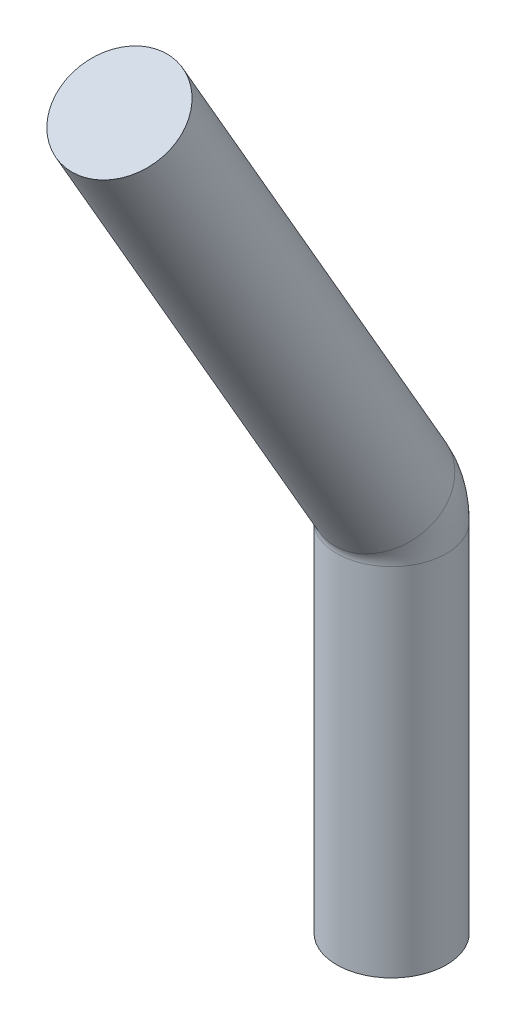
ISO-10303-21;
HEADER;
FILE_DESCRIPTION(('STEP AP214'),'2;1');
FILE_NAME('part.step','',(''),(''),'','','');
FILE_SCHEMA(('AUTOMOTIVE_DESIGN { 1 0 10303 214 1 1 1 1 }'));
ENDSEC;
DATA;
#1=APPLICATION_CONTEXT('core data for automotive mechanical design processes');
#2=APPLICATION_PROTOCOL_DEFINITION('international standard','automotive_design',2000,#1);
#3=PRODUCT_CONTEXT('',#1,'mechanical');
#4=PRODUCT('Part','Part','',(#3));
#5=PRODUCT_RELATED_PRODUCT_CATEGORY('part','',(#4));
#6=PRODUCT_DEFINITION_FORMATION('','',#4);
#7=PRODUCT_DEFINITION_CONTEXT('part definition',#1,'design');
#8=PRODUCT_DEFINITION('design','',#6,#7);
#9=PRODUCT_DEFINITION_SHAPE('','',#8);
#10=(LENGTH_UNIT() NAMED_UNIT(*) SI_UNIT(.MILLI.,.METRE.));
#11=(NAMED_UNIT(*) PLANE_ANGLE_UNIT() SI_UNIT($,.RADIAN.));
#12=(NAMED_UNIT(*) SI_UNIT($,.STERADIAN.) SOLID_ANGLE_UNIT());
#13=UNCERTAINTY_MEASURE_WITH_UNIT(LENGTH_MEASURE(1.E-05),#10,'distance_accuracy_value','');
#14=(GEOMETRIC_REPRESENTATION_CONTEXT(3) GLOBAL_UNCERTAINTY_ASSIGNED_CONTEXT((#13)) GLOBAL_UNIT_ASSIGNED_CONTEXT((#10,
#11,#12)) REPRESENTATION_CONTEXT('',''));
#15=CARTESIAN_POINT('',(0.,0.,0.));
#16=DIRECTION('',(0.,0.,1.));
#17=DIRECTION('',(1.,0.,0.));
#18=AXIS2_PLACEMENT_3D('',#15,#16,#17);
#19=CARTESIAN_POINT('',(0.,4.69711431702997,2.33038475772934));
#20=DIRECTION('',(0.,0.866025403784438,0.500000000000001));
#21=DIRECTION('',(0.,-0.500000000000001,0.866025403784438));
#22=AXIS2_PLACEMENT_3D('',#19,#20,#21);
#23=PLANE('',#22);
#24=CARTESIAN_POINT('',(0.,4.69711431702997,2.33038475772934));
#25=DIRECTION('',(0.,0.866025403784438,0.500000000000001));
#26=DIRECTION('',(0.,-0.500000000000001,0.866025403784438));
#27=AXIS2_PLACEMENT_3D('',#24,#25,#26);
#28=CIRCLE('',#27,0.47);
#29=CARTESIAN_POINT('',(0.,4.46211431702997,2.73741669750803));
#30=VERTEX_POINT('',#29);
#31=EDGE_CURVE('E10',#30,#30,#28,.T.);
#32=ORIENTED_EDGE('',*,*,#31,.T.);
#33=EDGE_LOOP('',(#32));
#34=FACE_BOUND('',#33,.T.);
#35=ADVANCED_FACE('F37',(#34),#23,.T.);
#36=CARTESIAN_POINT('',(0.,0.,0.));
#37=DIRECTION('',(0.,1.,0.));
#38=DIRECTION('',(0.,0.,1.));
#39=AXIS2_PLACEMENT_3D('',#36,#37,#38);
#40=CYLINDRICAL_SURFACE('',#39,0.47);
#41=CARTESIAN_POINT('',(0.,0.5,0.));
#42=DIRECTION('',(0.,1.,0.));
#43=DIRECTION('',(0.,0.,1.));
#44=AXIS2_PLACEMENT_3D('',#41,#42,#43);
#45=CIRCLE('',#44,0.47);
#46=CARTESIAN_POINT('',(0.,0.5,-0.47));
#47=VERTEX_POINT('',#46);
#48=EDGE_CURVE('E49',#47,#47,#45,.T.);
#49=ORIENTED_EDGE('',*,*,#48,.F.);
#50=EDGE_LOOP('',(#49));
#51=FACE_BOUND('',#50,.T.);
#52=CARTESIAN_POINT('',(0.,-2.55,0.));
#53=DIRECTION('',(0.,-1.,0.));
#54=DIRECTION('',(0.,0.,-1.));
#55=AXIS2_PLACEMENT_3D('',#52,#53,#54);
#56=CIRCLE('',#55,0.47);
#57=CARTESIAN_POINT('',(0.,-2.55,-0.47));
#58=VERTEX_POINT('',#57);
#59=EDGE_CURVE('E54',#58,#58,#56,.T.);
#60=ORIENTED_EDGE('',*,*,#59,.F.);
#61=EDGE_LOOP('',(#60));
#62=FACE_BOUND('',#61,.T.);
#63=ADVANCED_FACE('F63',(#51,#62),#40,.T.);
#64=CARTESIAN_POINT('',(0.,0.5,0.6));
#65=DIRECTION('',(1.,0.,0.));
#66=DIRECTION('',(0.,0.,-1.));
#67=AXIS2_PLACEMENT_3D('',#64,#65,#66);
#68=TOROIDAL_SURFACE('',#67,0.6,0.47);
#69=CARTESIAN_POINT('',(0.,0.800000000000001,0.0803847577293372));
#70=DIRECTION('',(0.,0.866025403784438,0.500000000000001));
#71=DIRECTION('',(0.,-0.500000000000001,0.866025403784438));
#72=AXIS2_PLACEMENT_3D('',#69,#70,#71);
#73=CIRCLE('',#72,0.47);
#74=CARTESIAN_POINT('',(0.,1.035,-0.326647182049348));
#75=VERTEX_POINT('',#74);
#76=EDGE_CURVE('E44',#75,#75,#73,.T.);
#77=CARTESIAN_POINT('',(0.,0.5,0.6));
#78=DIRECTION('',(1.,0.,0.));
#79=DIRECTION('',(0.,0.,-1.));
#80=AXIS2_PLACEMENT_3D('',#77,#78,#79);
#81=CIRCLE('',#80,1.07);
#82=EDGE_CURVE('',#47,#75,#81,.T.);
#83=ORIENTED_EDGE('',*,*,#48,.T.);
#84=ORIENTED_EDGE('',*,*,#76,.F.);
#85=ORIENTED_EDGE('',*,*,#82,.T.);
#86=ORIENTED_EDGE('',*,*,#82,.F.);
#87=EDGE_LOOP('',(#83,#85,#84,#86));
#88=FACE_BOUND('',#87,.T.);
#89=ADVANCED_FACE('F65',(#88),#68,.T.);
#90=CARTESIAN_POINT('',(0.,0.800000000000001,0.0803847577293372));
#91=DIRECTION('',(0.,0.866025403784438,0.500000000000001));
#92=DIRECTION('',(0.,-0.500000000000001,0.866025403784438));
#93=AXIS2_PLACEMENT_3D('',#90,#91,#92);
#94=CYLINDRICAL_SURFACE('',#93,0.47);
#95=ORIENTED_EDGE('',*,*,#31,.F.);
#96=EDGE_LOOP('',(#95));
#97=FACE_BOUND('',#96,.T.);
#98=ORIENTED_EDGE('',*,*,#76,.T.);
#99=EDGE_LOOP('',(#98));
#100=FACE_BOUND('',#99,.T.);
#101=ADVANCED_FACE('F72',(#97,#100),#94,.T.);
#102=CARTESIAN_POINT('',(0.,-2.55,0.));
#103=DIRECTION('',(0.,-1.,0.));
#104=DIRECTION('',(0.,0.,-1.));
#105=AXIS2_PLACEMENT_3D('',#102,#103,#104);
#106=PLANE('',#105);
#107=ORIENTED_EDGE('',*,*,#59,.T.);
#108=EDGE_LOOP('',(#107));
#109=FACE_BOUND('',#108,.T.);
#110=ADVANCED_FACE('F61',(#109),#106,.T.);
#111=CLOSED_SHELL('',(#35,#63,#89,#101,#110));
#112=MANIFOLD_SOLID_BREP('B2',#111);
#113=ADVANCED_BREP_SHAPE_REPRESENTATION('',(#18,#112),#14);
#114=SHAPE_DEFINITION_REPRESENTATION(#9,#113);
ENDSEC;
END-ISO-10303-21;
